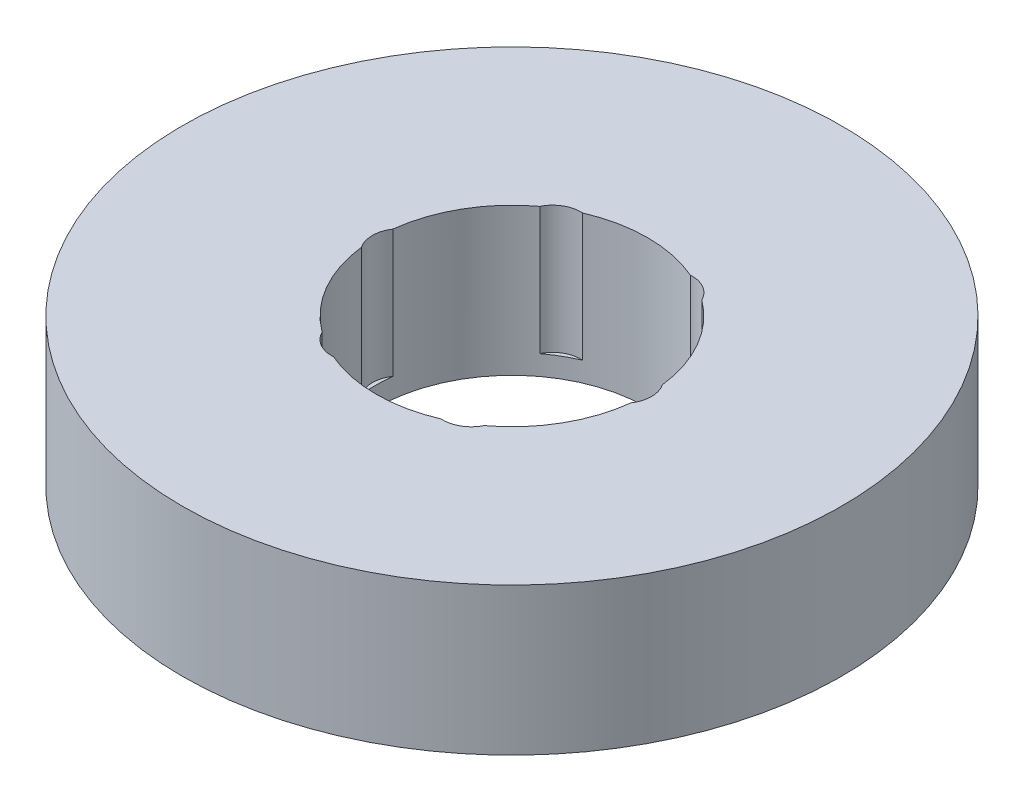
ISO-10303-21;
HEADER;
FILE_DESCRIPTION(('STEP AP214'),'2;1');
FILE_NAME('part.step','',(''),(''),'','','');
FILE_SCHEMA(('AUTOMOTIVE_DESIGN { 1 0 10303 214 1 1 1 1 }'));
ENDSEC;
DATA;
#1=APPLICATION_CONTEXT('core data for automotive mechanical design processes');
#2=APPLICATION_PROTOCOL_DEFINITION('international standard','automotive_design',2000,#1);
#3=PRODUCT_CONTEXT('',#1,'mechanical');
#4=PRODUCT('Part','Part','',(#3));
#5=PRODUCT_RELATED_PRODUCT_CATEGORY('part','',(#4));
#6=PRODUCT_DEFINITION_FORMATION('','',#4);
#7=PRODUCT_DEFINITION_CONTEXT('part definition',#1,'design');
#8=PRODUCT_DEFINITION('design','',#6,#7);
#9=PRODUCT_DEFINITION_SHAPE('','',#8);
#10=(LENGTH_UNIT() NAMED_UNIT(*) SI_UNIT(.MILLI.,.METRE.));
#11=(NAMED_UNIT(*) PLANE_ANGLE_UNIT() SI_UNIT($,.RADIAN.));
#12=(NAMED_UNIT(*) SI_UNIT($,.STERADIAN.) SOLID_ANGLE_UNIT());
#13=UNCERTAINTY_MEASURE_WITH_UNIT(LENGTH_MEASURE(1.E-05),#10,'distance_accuracy_value','');
#14=(GEOMETRIC_REPRESENTATION_CONTEXT(3) GLOBAL_UNCERTAINTY_ASSIGNED_CONTEXT((#13)) GLOBAL_UNIT_ASSIGNED_CONTEXT((#10,
#11,#12)) REPRESENTATION_CONTEXT('',''));
#15=CARTESIAN_POINT('',(0.,0.,0.));
#16=DIRECTION('',(0.,0.,1.));
#17=DIRECTION('',(1.,0.,0.));
#18=AXIS2_PLACEMENT_3D('',#15,#16,#17);
#19=CARTESIAN_POINT('',(0.,19.,0.));
#20=DIRECTION('',(0.,-1.,0.));
#21=DIRECTION('',(0.,0.,-1.));
#22=AXIS2_PLACEMENT_3D('',#19,#20,#21);
#23=CYLINDRICAL_SURFACE('',#22,42.5);
#24=CARTESIAN_POINT('',(0.,19.,0.));
#25=DIRECTION('',(0.,1.,0.));
#26=DIRECTION('',(0.,0.,1.));
#27=AXIS2_PLACEMENT_3D('',#24,#25,#26);
#28=CIRCLE('',#27,42.5);
#29=CARTESIAN_POINT('',(0.,19.,42.5));
#30=VERTEX_POINT('',#29);
#31=EDGE_CURVE('E162',#30,#30,#28,.T.);
#32=ORIENTED_EDGE('',*,*,#31,.F.);
#33=EDGE_LOOP('',(#32));
#34=FACE_BOUND('',#33,.T.);
#35=CARTESIAN_POINT('',(0.,0.,0.));
#36=DIRECTION('',(0.,1.,0.));
#37=DIRECTION('',(0.,0.,1.));
#38=AXIS2_PLACEMENT_3D('',#35,#36,#37);
#39=CIRCLE('',#38,42.5);
#40=CARTESIAN_POINT('',(0.,0.,42.5));
#41=VERTEX_POINT('',#40);
#42=EDGE_CURVE('E157',#41,#41,#39,.T.);
#43=ORIENTED_EDGE('',*,*,#42,.T.);
#44=EDGE_LOOP('',(#43));
#45=FACE_BOUND('',#44,.T.);
#46=ADVANCED_FACE('F39',(#34,#45),#23,.T.);
#47=CARTESIAN_POINT('',(0.,19.,0.));
#48=DIRECTION('',(0.,1.,0.));
#49=DIRECTION('',(0.,0.,1.));
#50=AXIS2_PLACEMENT_3D('',#47,#48,#49);
#51=PLANE('',#50);
#52=CARTESIAN_POINT('',(-7.1815137238901,19.,-12.4387466450305));
#53=DIRECTION('',(0.,1.,0.));
#54=DIRECTION('',(-0.866025403784433,0.,0.50000000000001));
#55=AXIS2_PLACEMENT_3D('',#52,#53,#54);
#56=CIRCLE('',#55,3.63337496775995);
#57=CARTESIAN_POINT('',(-6.94196982842239,19.,-16.0642165978075));
#58=VERTEX_POINT('',#57);
#59=CARTESIAN_POINT('',(-10.441034751386,19.,-14.0440305226224));
#60=VERTEX_POINT('',#59);
#61=EDGE_CURVE('E218',#58,#60,#56,.T.);
#62=ORIENTED_EDGE('',*,*,#61,.F.);
#63=CARTESIAN_POINT('',(0.,19.,0.));
#64=DIRECTION('',(0.,1.,0.));
#65=DIRECTION('',(0.,0.,1.));
#66=AXIS2_PLACEMENT_3D('',#63,#64,#65);
#67=CIRCLE('',#66,17.5);
#68=CARTESIAN_POINT('',(6.94196982842205,19.,-16.0642165978076));
#69=VERTEX_POINT('',#68);
#70=EDGE_CURVE('E169',#69,#58,#67,.T.);
#71=ORIENTED_EDGE('',*,*,#70,.F.);
#72=CARTESIAN_POINT('',(7.18151372388984,19.,-12.4387466450306));
#73=DIRECTION('',(0.,1.,0.));
#74=DIRECTION('',(-0.866025403784443,0.,-0.499999999999992));
#75=AXIS2_PLACEMENT_3D('',#72,#73,#74);
#76=CIRCLE('',#75,3.63337496775995);
#77=CARTESIAN_POINT('',(10.4410347513857,19.,-14.0440305226226));
#78=VERTEX_POINT('',#77);
#79=EDGE_CURVE('E285',#78,#69,#76,.T.);
#80=ORIENTED_EDGE('',*,*,#79,.F.);
#81=CARTESIAN_POINT('',(17.3830045798081,19.,-2.02018607518505));
#82=VERTEX_POINT('',#81);
#83=EDGE_CURVE('E174',#82,#78,#67,.T.);
#84=ORIENTED_EDGE('',*,*,#83,.F.);
#85=CARTESIAN_POINT('',(14.3630274477799,19.,0.));
#86=DIRECTION('',(0.,1.,0.));
#87=DIRECTION('',(0.,0.,-1.));
#88=AXIS2_PLACEMENT_3D('',#85,#86,#87);
#89=CIRCLE('',#88,3.63337496775995);
#90=CARTESIAN_POINT('',(17.3830045798081,19.,2.02018607518505));
#91=VERTEX_POINT('',#90);
#92=EDGE_CURVE('E280',#91,#82,#89,.T.);
#93=ORIENTED_EDGE('',*,*,#92,.F.);
#94=CARTESIAN_POINT('',(10.4410347513859,19.,14.0440305226225));
#95=VERTEX_POINT('',#94);
#96=EDGE_CURVE('E164',#95,#91,#67,.T.);
#97=ORIENTED_EDGE('',*,*,#96,.F.);
#98=CARTESIAN_POINT('',(7.18151372389002,19.,12.4387466450305));
#99=DIRECTION('',(0.,1.,0.));
#100=DIRECTION('',(0.866025403784436,0.,-0.500000000000004));
#101=AXIS2_PLACEMENT_3D('',#98,#99,#100);
#102=CIRCLE('',#101,3.63337496775995);
#103=CARTESIAN_POINT('',(6.94196982842227,19.,16.0642165978075));
#104=VERTEX_POINT('',#103);
#105=EDGE_CURVE('E269',#104,#95,#102,.T.);
#106=ORIENTED_EDGE('',*,*,#105,.F.);
#107=CARTESIAN_POINT('',(-6.94196982842217,19.,16.0642165978076));
#108=VERTEX_POINT('',#107);
#109=EDGE_CURVE('E149',#108,#104,#67,.T.);
#110=ORIENTED_EDGE('',*,*,#109,.F.);
#111=CARTESIAN_POINT('',(-7.18151372388993,19.,12.4387466450306));
#112=DIRECTION('',(0.,1.,0.));
#113=DIRECTION('',(0.86602540378444,0.,0.499999999999998));
#114=AXIS2_PLACEMENT_3D('',#111,#112,#113);
#115=CIRCLE('',#114,3.63337496775995);
#116=CARTESIAN_POINT('',(-10.4410347513858,19.,14.0440305226225));
#117=VERTEX_POINT('',#116);
#118=EDGE_CURVE('E128',#117,#108,#115,.T.);
#119=ORIENTED_EDGE('',*,*,#118,.F.);
#120=CARTESIAN_POINT('',(-17.3830045798081,19.,2.02018607518505));
#121=VERTEX_POINT('',#120);
#122=EDGE_CURVE('E148',#121,#117,#67,.T.);
#123=ORIENTED_EDGE('',*,*,#122,.F.);
#124=CARTESIAN_POINT('',(-14.3630274477799,19.,0.));
#125=DIRECTION('',(0.,1.,0.));
#126=DIRECTION('',(0.,0.,1.));
#127=AXIS2_PLACEMENT_3D('',#124,#125,#126);
#128=CIRCLE('',#127,3.63337496775995);
#129=CARTESIAN_POINT('',(-17.3830045798081,19.,-2.02018607518505));
#130=VERTEX_POINT('',#129);
#131=EDGE_CURVE('E179',#130,#121,#128,.T.);
#132=ORIENTED_EDGE('',*,*,#131,.F.);
#133=EDGE_CURVE('E161',#60,#130,#67,.T.);
#134=ORIENTED_EDGE('',*,*,#133,.F.);
#135=EDGE_LOOP('',(#62,#71,#80,#84,#93,#97,#106,#110,#119,#123,#132,#134));
#136=FACE_BOUND('',#135,.T.);
#137=ORIENTED_EDGE('',*,*,#31,.T.);
#138=EDGE_LOOP('',(#137));
#139=FACE_BOUND('',#138,.T.);
#140=ADVANCED_FACE('F141',(#136,#139),#51,.T.);
#141=CARTESIAN_POINT('',(0.,0.,0.));
#142=DIRECTION('',(0.,1.,0.));
#143=DIRECTION('',(0.,0.,1.));
#144=AXIS2_PLACEMENT_3D('',#141,#142,#143);
#145=PLANE('',#144);
#146=CARTESIAN_POINT('',(0.,0.,0.));
#147=DIRECTION('',(0.,1.,0.));
#148=DIRECTION('',(0.,0.,1.));
#149=AXIS2_PLACEMENT_3D('',#146,#147,#148);
#150=CIRCLE('',#149,17.5);
#151=CARTESIAN_POINT('',(0.,0.,17.5));
#152=VERTEX_POINT('',#151);
#153=EDGE_CURVE('E166',#152,#152,#150,.T.);
#154=ORIENTED_EDGE('',*,*,#153,.T.);
#155=EDGE_LOOP('',(#154));
#156=FACE_BOUND('',#155,.T.);
#157=ORIENTED_EDGE('',*,*,#42,.F.);
#158=EDGE_LOOP('',(#157));
#159=FACE_BOUND('',#158,.T.);
#160=ADVANCED_FACE('F234',(#156,#159),#145,.F.);
#161=CARTESIAN_POINT('',(0.,19.,0.));
#162=DIRECTION('',(0.,-1.,0.));
#163=DIRECTION('',(0.,0.,-1.));
#164=AXIS2_PLACEMENT_3D('',#161,#162,#163);
#165=CYLINDRICAL_SURFACE('',#164,17.5);
#166=DIRECTION('',(0.,1.,0.));
#167=VECTOR('',#166,1.);
#168=CARTESIAN_POINT('',(-6.94196982842239,10.776932740518,-16.0642165978075));
#169=LINE('',#168,#167);
#170=CARTESIAN_POINT('',(-6.94196982842239,2.55386548103604,-16.0642165978075));
#171=VERTEX_POINT('',#170);
#172=EDGE_CURVE('E11',#171,#58,#169,.T.);
#173=ORIENTED_EDGE('',*,*,#172,.F.);
#174=CARTESIAN_POINT('',(0.,2.55386548103604,0.));
#175=DIRECTION('',(0.,1.,0.));
#176=DIRECTION('',(0.,0.,1.));
#177=AXIS2_PLACEMENT_3D('',#174,#175,#176);
#178=CIRCLE('',#177,17.5);
#179=CARTESIAN_POINT('',(-10.441034751386,2.55386548103604,-14.0440305226224));
#180=VERTEX_POINT('',#179);
#181=EDGE_CURVE('E214',#171,#180,#178,.T.);
#182=ORIENTED_EDGE('',*,*,#181,.T.);
#183=DIRECTION('',(0.,1.,0.));
#184=VECTOR('',#183,1.);
#185=CARTESIAN_POINT('',(-10.441034751386,10.776932740518,-14.0440305226224));
#186=LINE('',#185,#184);
#187=EDGE_CURVE('E46',#60,#180,#186,.F.);
#188=ORIENTED_EDGE('',*,*,#187,.F.);
#189=ORIENTED_EDGE('',*,*,#133,.T.);
#190=DIRECTION('',(0.,1.,0.));
#191=VECTOR('',#190,1.);
#192=CARTESIAN_POINT('',(-17.3830045798081,10.776932740518,-2.02018607518505));
#193=LINE('',#192,#191);
#194=CARTESIAN_POINT('',(-17.3830045798081,2.55386548103604,-2.02018607518505));
#195=VERTEX_POINT('',#194);
#196=EDGE_CURVE('E187',#195,#130,#193,.T.);
#197=ORIENTED_EDGE('',*,*,#196,.F.);
#198=CARTESIAN_POINT('',(0.,2.55386548103604,0.));
#199=DIRECTION('',(0.,1.,0.));
#200=DIRECTION('',(0.,0.,1.));
#201=AXIS2_PLACEMENT_3D('',#198,#199,#200);
#202=CIRCLE('',#201,17.5);
#203=CARTESIAN_POINT('',(-17.3830045798081,2.55386548103604,2.02018607518505));
#204=VERTEX_POINT('',#203);
#205=EDGE_CURVE('E184',#195,#204,#202,.T.);
#206=ORIENTED_EDGE('',*,*,#205,.T.);
#207=DIRECTION('',(0.,1.,0.));
#208=VECTOR('',#207,1.);
#209=CARTESIAN_POINT('',(-17.3830045798081,10.776932740518,2.02018607518505));
#210=LINE('',#209,#208);
#211=EDGE_CURVE('E158',#121,#204,#210,.F.);
#212=ORIENTED_EDGE('',*,*,#211,.F.);
#213=ORIENTED_EDGE('',*,*,#122,.T.);
#214=DIRECTION('',(0.,1.,0.));
#215=VECTOR('',#214,1.);
#216=CARTESIAN_POINT('',(-10.4410347513858,10.776932740518,14.0440305226225));
#217=LINE('',#216,#215);
#218=CARTESIAN_POINT('',(-10.4410347513858,2.55386548103604,14.0440305226225));
#219=VERTEX_POINT('',#218);
#220=EDGE_CURVE('E127',#219,#117,#217,.T.);
#221=ORIENTED_EDGE('',*,*,#220,.F.);
#222=CARTESIAN_POINT('',(0.,2.55386548103604,0.));
#223=DIRECTION('',(0.,1.,0.));
#224=DIRECTION('',(0.,0.,1.));
#225=AXIS2_PLACEMENT_3D('',#222,#223,#224);
#226=CIRCLE('',#225,17.5);
#227=CARTESIAN_POINT('',(-6.94196982842217,2.55386548103604,16.0642165978076));
#228=VERTEX_POINT('',#227);
#229=EDGE_CURVE('E189',#219,#228,#226,.T.);
#230=ORIENTED_EDGE('',*,*,#229,.T.);
#231=DIRECTION('',(0.,1.,0.));
#232=VECTOR('',#231,1.);
#233=CARTESIAN_POINT('',(-6.94196982842217,10.776932740518,16.0642165978076));
#234=LINE('',#233,#232);
#235=EDGE_CURVE('E140',#108,#228,#234,.F.);
#236=ORIENTED_EDGE('',*,*,#235,.F.);
#237=ORIENTED_EDGE('',*,*,#109,.T.);
#238=DIRECTION('',(0.,1.,0.));
#239=VECTOR('',#238,1.);
#240=CARTESIAN_POINT('',(6.94196982842228,10.776932740518,16.0642165978075));
#241=LINE('',#240,#239);
#242=CARTESIAN_POINT('',(6.94196982842227,2.55386548103604,16.0642165978075));
#243=VERTEX_POINT('',#242);
#244=EDGE_CURVE('E196',#243,#104,#241,.T.);
#245=ORIENTED_EDGE('',*,*,#244,.F.);
#246=CARTESIAN_POINT('',(0.,2.55386548103604,0.));
#247=DIRECTION('',(0.,1.,0.));
#248=DIRECTION('',(0.,0.,1.));
#249=AXIS2_PLACEMENT_3D('',#246,#247,#248);
#250=CIRCLE('',#249,17.5);
#251=CARTESIAN_POINT('',(10.4410347513859,2.55386548103604,14.0440305226225));
#252=VERTEX_POINT('',#251);
#253=EDGE_CURVE('E136',#243,#252,#250,.T.);
#254=ORIENTED_EDGE('',*,*,#253,.T.);
#255=DIRECTION('',(0.,1.,0.));
#256=VECTOR('',#255,1.);
#257=CARTESIAN_POINT('',(10.4410347513859,10.776932740518,14.0440305226225));
#258=LINE('',#257,#256);
#259=EDGE_CURVE('E194',#95,#252,#258,.F.);
#260=ORIENTED_EDGE('',*,*,#259,.F.);
#261=ORIENTED_EDGE('',*,*,#96,.T.);
#262=DIRECTION('',(0.,1.,0.));
#263=VECTOR('',#262,1.);
#264=CARTESIAN_POINT('',(17.3830045798081,10.776932740518,2.02018607518505));
#265=LINE('',#264,#263);
#266=CARTESIAN_POINT('',(17.3830045798081,2.55386548103604,2.02018607518505));
#267=VERTEX_POINT('',#266);
#268=EDGE_CURVE('E206',#267,#91,#265,.T.);
#269=ORIENTED_EDGE('',*,*,#268,.F.);
#270=CARTESIAN_POINT('',(0.,2.55386548103604,0.));
#271=DIRECTION('',(0.,1.,0.));
#272=DIRECTION('',(0.,0.,1.));
#273=AXIS2_PLACEMENT_3D('',#270,#271,#272);
#274=CIRCLE('',#273,17.5);
#275=CARTESIAN_POINT('',(17.3830045798081,2.55386548103604,-2.02018607518505));
#276=VERTEX_POINT('',#275);
#277=EDGE_CURVE('E199',#267,#276,#274,.T.);
#278=ORIENTED_EDGE('',*,*,#277,.T.);
#279=DIRECTION('',(0.,1.,0.));
#280=VECTOR('',#279,1.);
#281=CARTESIAN_POINT('',(17.3830045798081,10.776932740518,-2.02018607518505));
#282=LINE('',#281,#280);
#283=EDGE_CURVE('E201',#82,#276,#282,.F.);
#284=ORIENTED_EDGE('',*,*,#283,.F.);
#285=ORIENTED_EDGE('',*,*,#83,.T.);
#286=DIRECTION('',(0.,1.,0.));
#287=VECTOR('',#286,1.);
#288=CARTESIAN_POINT('',(10.4410347513857,10.776932740518,-14.0440305226226));
#289=LINE('',#288,#287);
#290=CARTESIAN_POINT('',(10.4410347513857,2.55386548103604,-14.0440305226226));
#291=VERTEX_POINT('',#290);
#292=EDGE_CURVE('E213',#291,#78,#289,.T.);
#293=ORIENTED_EDGE('',*,*,#292,.F.);
#294=CARTESIAN_POINT('',(0.,2.55386548103604,0.));
#295=DIRECTION('',(0.,1.,0.));
#296=DIRECTION('',(0.,0.,1.));
#297=AXIS2_PLACEMENT_3D('',#294,#295,#296);
#298=CIRCLE('',#297,17.5);
#299=CARTESIAN_POINT('',(6.94196982842205,2.55386548103604,-16.0642165978076));
#300=VERTEX_POINT('',#299);
#301=EDGE_CURVE('E208',#291,#300,#298,.T.);
#302=ORIENTED_EDGE('',*,*,#301,.T.);
#303=DIRECTION('',(0.,1.,0.));
#304=VECTOR('',#303,1.);
#305=CARTESIAN_POINT('',(6.94196982842205,10.776932740518,-16.0642165978076));
#306=LINE('',#305,#304);
#307=EDGE_CURVE('E211',#69,#300,#306,.F.);
#308=ORIENTED_EDGE('',*,*,#307,.F.);
#309=ORIENTED_EDGE('',*,*,#70,.T.);
#310=EDGE_LOOP('',(#173,#182,#188,#189,#197,#206,#212,#213,#221,#230,#236,#237,#245,#254,#260,
#261,#269,#278,#284,#285,#293,#302,#308,#309));
#311=FACE_BOUND('',#310,.T.);
#312=ORIENTED_EDGE('',*,*,#153,.F.);
#313=EDGE_LOOP('',(#312));
#314=FACE_BOUND('',#313,.T.);
#315=ADVANCED_FACE('F152',(#311,#314),#165,.F.);
#316=CARTESIAN_POINT('',(-14.3630274477799,2.55386548103604,0.));
#317=DIRECTION('',(0.,1.,0.));
#318=DIRECTION('',(0.,0.,1.));
#319=AXIS2_PLACEMENT_3D('',#316,#317,#318);
#320=CYLINDRICAL_SURFACE('',#319,3.63337496775995);
#321=ORIENTED_EDGE('',*,*,#196,.T.);
#322=ORIENTED_EDGE('',*,*,#131,.T.);
#323=ORIENTED_EDGE('',*,*,#211,.T.);
#324=CARTESIAN_POINT('',(-14.3630274477799,2.55386548103604,0.));
#325=DIRECTION('',(0.,1.,0.));
#326=DIRECTION('',(0.,0.,1.));
#327=AXIS2_PLACEMENT_3D('',#324,#325,#326);
#328=CIRCLE('',#327,3.63337496775995);
#329=EDGE_CURVE('E180',#195,#204,#328,.T.);
#330=ORIENTED_EDGE('',*,*,#329,.F.);
#331=EDGE_LOOP('',(#321,#322,#323,#330));
#332=FACE_BOUND('',#331,.T.);
#333=ADVANCED_FACE('F244',(#332),#320,.F.);
#334=CARTESIAN_POINT('',(-14.3630274477799,2.55386548103604,0.));
#335=DIRECTION('',(0.,1.,0.));
#336=DIRECTION('',(0.,0.,1.));
#337=AXIS2_PLACEMENT_3D('',#334,#335,#336);
#338=PLANE('',#337);
#339=ORIENTED_EDGE('',*,*,#329,.T.);
#340=ORIENTED_EDGE('',*,*,#205,.F.);
#341=EDGE_LOOP('',(#339,#340));
#342=FACE_BOUND('',#341,.T.);
#343=ADVANCED_FACE('F248',(#342),#338,.T.);
#344=CARTESIAN_POINT('',(-7.18151372388993,2.55386548103604,12.4387466450306));
#345=DIRECTION('',(0.,1.,0.));
#346=DIRECTION('',(0.,0.,1.));
#347=AXIS2_PLACEMENT_3D('',#344,#345,#346);
#348=CYLINDRICAL_SURFACE('',#347,3.63337496775995);
#349=ORIENTED_EDGE('',*,*,#220,.T.);
#350=ORIENTED_EDGE('',*,*,#118,.T.);
#351=ORIENTED_EDGE('',*,*,#235,.T.);
#352=CARTESIAN_POINT('',(-7.18151372388993,2.55386548103604,12.4387466450306));
#353=DIRECTION('',(0.,1.,0.));
#354=DIRECTION('',(0.86602540378444,0.,0.499999999999998));
#355=AXIS2_PLACEMENT_3D('',#352,#353,#354);
#356=CIRCLE('',#355,3.63337496775995);
#357=EDGE_CURVE('E135',#219,#228,#356,.T.);
#358=ORIENTED_EDGE('',*,*,#357,.F.);
#359=EDGE_LOOP('',(#349,#350,#351,#358));
#360=FACE_BOUND('',#359,.T.);
#361=ADVANCED_FACE('F126',(#360),#348,.F.);
#362=CARTESIAN_POINT('',(-7.18151372388993,2.55386548103604,12.4387466450306));
#363=DIRECTION('',(0.,1.,0.));
#364=DIRECTION('',(0.86602540378444,0.,0.499999999999998));
#365=AXIS2_PLACEMENT_3D('',#362,#363,#364);
#366=PLANE('',#365);
#367=ORIENTED_EDGE('',*,*,#357,.T.);
#368=ORIENTED_EDGE('',*,*,#229,.F.);
#369=EDGE_LOOP('',(#367,#368));
#370=FACE_BOUND('',#369,.T.);
#371=ADVANCED_FACE('F258',(#370),#366,.T.);
#372=CARTESIAN_POINT('',(7.18151372389002,2.55386548103604,12.4387466450305));
#373=DIRECTION('',(0.,1.,0.));
#374=DIRECTION('',(0.,0.,1.));
#375=AXIS2_PLACEMENT_3D('',#372,#373,#374);
#376=CYLINDRICAL_SURFACE('',#375,3.63337496775995);
#377=ORIENTED_EDGE('',*,*,#244,.T.);
#378=ORIENTED_EDGE('',*,*,#105,.T.);
#379=ORIENTED_EDGE('',*,*,#259,.T.);
#380=CARTESIAN_POINT('',(7.18151372389002,2.55386548103604,12.4387466450305));
#381=DIRECTION('',(0.,1.,0.));
#382=DIRECTION('',(0.866025403784436,0.,-0.500000000000004));
#383=AXIS2_PLACEMENT_3D('',#380,#381,#382);
#384=CIRCLE('',#383,3.63337496775995);
#385=EDGE_CURVE('E147',#243,#252,#384,.T.);
#386=ORIENTED_EDGE('',*,*,#385,.F.);
#387=EDGE_LOOP('',(#377,#378,#379,#386));
#388=FACE_BOUND('',#387,.T.);
#389=ADVANCED_FACE('F256',(#388),#376,.F.);
#390=CARTESIAN_POINT('',(7.18151372389002,2.55386548103604,12.4387466450305));
#391=DIRECTION('',(0.,1.,0.));
#392=DIRECTION('',(0.866025403784436,0.,-0.500000000000004));
#393=AXIS2_PLACEMENT_3D('',#390,#391,#392);
#394=PLANE('',#393);
#395=ORIENTED_EDGE('',*,*,#385,.T.);
#396=ORIENTED_EDGE('',*,*,#253,.F.);
#397=EDGE_LOOP('',(#395,#396));
#398=FACE_BOUND('',#397,.T.);
#399=ADVANCED_FACE('F263',(#398),#394,.T.);
#400=CARTESIAN_POINT('',(14.3630274477799,2.55386548103604,0.));
#401=DIRECTION('',(0.,1.,0.));
#402=DIRECTION('',(0.,0.,1.));
#403=AXIS2_PLACEMENT_3D('',#400,#401,#402);
#404=CYLINDRICAL_SURFACE('',#403,3.63337496775995);
#405=ORIENTED_EDGE('',*,*,#268,.T.);
#406=ORIENTED_EDGE('',*,*,#92,.T.);
#407=ORIENTED_EDGE('',*,*,#283,.T.);
#408=CARTESIAN_POINT('',(14.3630274477799,2.55386548103604,0.));
#409=DIRECTION('',(0.,1.,0.));
#410=DIRECTION('',(0.,0.,-1.));
#411=AXIS2_PLACEMENT_3D('',#408,#409,#410);
#412=CIRCLE('',#411,3.63337496775995);
#413=EDGE_CURVE('E273',#267,#276,#412,.T.);
#414=ORIENTED_EDGE('',*,*,#413,.F.);
#415=EDGE_LOOP('',(#405,#406,#407,#414));
#416=FACE_BOUND('',#415,.T.);
#417=ADVANCED_FACE('F297',(#416),#404,.F.);
#418=CARTESIAN_POINT('',(14.3630274477799,2.55386548103604,0.));
#419=DIRECTION('',(0.,1.,0.));
#420=DIRECTION('',(0.,0.,-1.));
#421=AXIS2_PLACEMENT_3D('',#418,#419,#420);
#422=PLANE('',#421);
#423=ORIENTED_EDGE('',*,*,#413,.T.);
#424=ORIENTED_EDGE('',*,*,#277,.F.);
#425=EDGE_LOOP('',(#423,#424));
#426=FACE_BOUND('',#425,.T.);
#427=ADVANCED_FACE('F299',(#426),#422,.T.);
#428=CARTESIAN_POINT('',(7.18151372388984,2.55386548103604,-12.4387466450306));
#429=DIRECTION('',(0.,1.,0.));
#430=DIRECTION('',(0.,0.,1.));
#431=AXIS2_PLACEMENT_3D('',#428,#429,#430);
#432=CYLINDRICAL_SURFACE('',#431,3.63337496775995);
#433=ORIENTED_EDGE('',*,*,#292,.T.);
#434=ORIENTED_EDGE('',*,*,#79,.T.);
#435=ORIENTED_EDGE('',*,*,#307,.T.);
#436=CARTESIAN_POINT('',(7.18151372388984,2.55386548103604,-12.4387466450306));
#437=DIRECTION('',(0.,1.,0.));
#438=DIRECTION('',(-0.866025403784443,0.,-0.499999999999992));
#439=AXIS2_PLACEMENT_3D('',#436,#437,#438);
#440=CIRCLE('',#439,3.63337496775995);
#441=EDGE_CURVE('E56',#291,#300,#440,.T.);
#442=ORIENTED_EDGE('',*,*,#441,.F.);
#443=EDGE_LOOP('',(#433,#434,#435,#442));
#444=FACE_BOUND('',#443,.T.);
#445=ADVANCED_FACE('F292',(#444),#432,.F.);
#446=CARTESIAN_POINT('',(7.18151372388984,2.55386548103604,-12.4387466450306));
#447=DIRECTION('',(0.,1.,0.));
#448=DIRECTION('',(-0.866025403784443,0.,-0.499999999999992));
#449=AXIS2_PLACEMENT_3D('',#446,#447,#448);
#450=PLANE('',#449);
#451=ORIENTED_EDGE('',*,*,#441,.T.);
#452=ORIENTED_EDGE('',*,*,#301,.F.);
#453=EDGE_LOOP('',(#451,#452));
#454=FACE_BOUND('',#453,.T.);
#455=ADVANCED_FACE('F226',(#454),#450,.T.);
#456=CARTESIAN_POINT('',(-7.1815137238901,2.55386548103604,-12.4387466450305));
#457=DIRECTION('',(0.,1.,0.));
#458=DIRECTION('',(0.,0.,1.));
#459=AXIS2_PLACEMENT_3D('',#456,#457,#458);
#460=CYLINDRICAL_SURFACE('',#459,3.63337496775995);
#461=ORIENTED_EDGE('',*,*,#172,.T.);
#462=ORIENTED_EDGE('',*,*,#61,.T.);
#463=ORIENTED_EDGE('',*,*,#187,.T.);
#464=CARTESIAN_POINT('',(-7.1815137238901,2.55386548103604,-12.4387466450305));
#465=DIRECTION('',(0.,1.,0.));
#466=DIRECTION('',(-0.866025403784433,0.,0.50000000000001));
#467=AXIS2_PLACEMENT_3D('',#464,#465,#466);
#468=CIRCLE('',#467,3.63337496775995);
#469=EDGE_CURVE('E55',#171,#180,#468,.T.);
#470=ORIENTED_EDGE('',*,*,#469,.F.);
#471=EDGE_LOOP('',(#461,#462,#463,#470));
#472=FACE_BOUND('',#471,.T.);
#473=ADVANCED_FACE('F217',(#472),#460,.F.);
#474=CARTESIAN_POINT('',(-7.1815137238901,2.55386548103604,-12.4387466450305));
#475=DIRECTION('',(0.,1.,0.));
#476=DIRECTION('',(-0.866025403784433,0.,0.50000000000001));
#477=AXIS2_PLACEMENT_3D('',#474,#475,#476);
#478=PLANE('',#477);
#479=ORIENTED_EDGE('',*,*,#469,.T.);
#480=ORIENTED_EDGE('',*,*,#181,.F.);
#481=EDGE_LOOP('',(#479,#480));
#482=FACE_BOUND('',#481,.T.);
#483=ADVANCED_FACE('F219',(#482),#478,.T.);
#484=CLOSED_SHELL('',(#46,#140,#160,#315,#333,#343,#361,#371,#389,#399,#417,#427,#445,#455,#473,#483));
#485=MANIFOLD_SOLID_BREP('B2',#484);
#486=ADVANCED_BREP_SHAPE_REPRESENTATION('',(#18,#485),#14);
#487=SHAPE_DEFINITION_REPRESENTATION(#9,#486);
ENDSEC;
END-ISO-10303-21;
